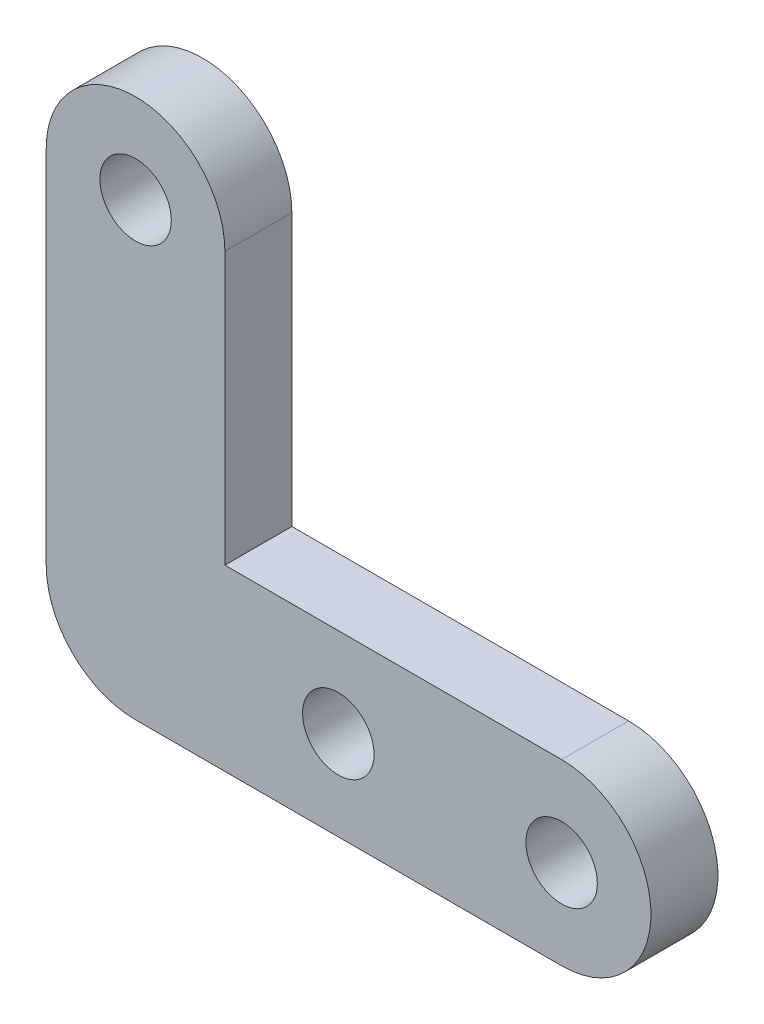
ISO-10303-21;
HEADER;
FILE_DESCRIPTION(('STEP AP214'),'2;1');
FILE_NAME('part.step','',(''),(''),'','','');
FILE_SCHEMA(('AUTOMOTIVE_DESIGN { 1 0 10303 214 1 1 1 1 }'));
ENDSEC;
DATA;
#1=APPLICATION_CONTEXT('core data for automotive mechanical design processes');
#2=APPLICATION_PROTOCOL_DEFINITION('international standard','automotive_design',2000,#1);
#3=PRODUCT_CONTEXT('',#1,'mechanical');
#4=PRODUCT('Part','Part','',(#3));
#5=PRODUCT_RELATED_PRODUCT_CATEGORY('part','',(#4));
#6=PRODUCT_DEFINITION_FORMATION('','',#4);
#7=PRODUCT_DEFINITION_CONTEXT('part definition',#1,'design');
#8=PRODUCT_DEFINITION('design','',#6,#7);
#9=PRODUCT_DEFINITION_SHAPE('','',#8);
#10=(LENGTH_UNIT() NAMED_UNIT(*) SI_UNIT(.MILLI.,.METRE.));
#11=(NAMED_UNIT(*) PLANE_ANGLE_UNIT() SI_UNIT($,.RADIAN.));
#12=(NAMED_UNIT(*) SI_UNIT($,.STERADIAN.) SOLID_ANGLE_UNIT());
#13=UNCERTAINTY_MEASURE_WITH_UNIT(LENGTH_MEASURE(1.E-05),#10,'distance_accuracy_value','');
#14=(GEOMETRIC_REPRESENTATION_CONTEXT(3) GLOBAL_UNCERTAINTY_ASSIGNED_CONTEXT((#13)) GLOBAL_UNIT_ASSIGNED_CONTEXT((#10,
#11,#12)) REPRESENTATION_CONTEXT('',''));
#15=CARTESIAN_POINT('',(0.,0.,0.));
#16=DIRECTION('',(0.,0.,1.));
#17=DIRECTION('',(1.,0.,0.));
#18=AXIS2_PLACEMENT_3D('',#15,#16,#17);
#19=CARTESIAN_POINT('',(0.,-4.,4.));
#20=DIRECTION('',(0.,-1.,0.));
#21=DIRECTION('',(1.,0.,0.));
#22=AXIS2_PLACEMENT_3D('',#19,#20,#21);
#23=PLANE('',#22);
#24=DIRECTION('',(0.,0.,1.));
#25=VECTOR('',#24,1.);
#26=CARTESIAN_POINT('',(0.,-4.,4.));
#27=LINE('',#26,#25);
#28=CARTESIAN_POINT('',(0.,-4.,1.));
#29=VERTEX_POINT('',#28);
#30=CARTESIAN_POINT('',(0.,-4.,4.));
#31=VERTEX_POINT('',#30);
#32=EDGE_CURVE('E11',#29,#31,#27,.T.);
#33=ORIENTED_EDGE('',*,*,#32,.F.);
#34=DIRECTION('',(1.,0.,0.));
#35=VECTOR('',#34,1.);
#36=CARTESIAN_POINT('',(0.,-4.,1.));
#37=LINE('',#36,#35);
#38=CARTESIAN_POINT('',(19.08,-4.,1.));
#39=VERTEX_POINT('',#38);
#40=EDGE_CURVE('E105',#29,#39,#37,.T.);
#41=ORIENTED_EDGE('',*,*,#40,.T.);
#42=DIRECTION('',(0.,0.,1.));
#43=VECTOR('',#42,1.);
#44=CARTESIAN_POINT('',(19.08,-4.,4.));
#45=LINE('',#44,#43);
#46=CARTESIAN_POINT('',(19.08,-4.,4.));
#47=VERTEX_POINT('',#46);
#48=EDGE_CURVE('E49',#39,#47,#45,.T.);
#49=ORIENTED_EDGE('',*,*,#48,.T.);
#50=DIRECTION('',(1.,0.,0.));
#51=VECTOR('',#50,1.);
#52=CARTESIAN_POINT('',(0.,-4.,4.));
#53=LINE('',#52,#51);
#54=EDGE_CURVE('E147',#31,#47,#53,.T.);
#55=ORIENTED_EDGE('',*,*,#54,.F.);
#56=EDGE_LOOP('',(#33,#41,#49,#55));
#57=FACE_BOUND('',#56,.T.);
#58=ADVANCED_FACE('F39',(#57),#23,.T.);
#59=CARTESIAN_POINT('',(19.08,0.,4.));
#60=DIRECTION('',(0.,0.,1.));
#61=DIRECTION('',(1.,0.,0.));
#62=AXIS2_PLACEMENT_3D('',#59,#60,#61);
#63=CYLINDRICAL_SURFACE('',#62,4.);
#64=ORIENTED_EDGE('',*,*,#48,.F.);
#65=CARTESIAN_POINT('',(19.08,0.,1.));
#66=DIRECTION('',(0.,0.,1.));
#67=DIRECTION('',(1.,0.,0.));
#68=AXIS2_PLACEMENT_3D('',#65,#66,#67);
#69=CIRCLE('',#68,4.);
#70=CARTESIAN_POINT('',(19.08,4.,1.));
#71=VERTEX_POINT('',#70);
#72=EDGE_CURVE('E121',#39,#71,#69,.T.);
#73=ORIENTED_EDGE('',*,*,#72,.T.);
#74=DIRECTION('',(0.,0.,1.));
#75=VECTOR('',#74,1.);
#76=CARTESIAN_POINT('',(19.08,4.,4.));
#77=LINE('',#76,#75);
#78=CARTESIAN_POINT('',(19.08,4.,4.));
#79=VERTEX_POINT('',#78);
#80=EDGE_CURVE('E140',#71,#79,#77,.T.);
#81=ORIENTED_EDGE('',*,*,#80,.T.);
#82=CARTESIAN_POINT('',(19.08,0.,4.));
#83=DIRECTION('',(0.,0.,1.));
#84=DIRECTION('',(1.,0.,0.));
#85=AXIS2_PLACEMENT_3D('',#82,#83,#84);
#86=CIRCLE('',#85,4.);
#87=EDGE_CURVE('E157',#47,#79,#86,.T.);
#88=ORIENTED_EDGE('',*,*,#87,.F.);
#89=EDGE_LOOP('',(#64,#73,#81,#88));
#90=FACE_BOUND('',#89,.T.);
#91=ADVANCED_FACE('F160',(#90),#63,.T.);
#92=CARTESIAN_POINT('',(0.,4.,4.));
#93=DIRECTION('',(0.,-1.,0.));
#94=DIRECTION('',(1.,0.,0.));
#95=AXIS2_PLACEMENT_3D('',#92,#93,#94);
#96=PLANE('',#95);
#97=ORIENTED_EDGE('',*,*,#80,.F.);
#98=DIRECTION('',(1.,0.,0.));
#99=VECTOR('',#98,1.);
#100=CARTESIAN_POINT('',(0.,4.,1.));
#101=LINE('',#100,#99);
#102=CARTESIAN_POINT('',(4.,4.,1.));
#103=VERTEX_POINT('',#102);
#104=EDGE_CURVE('E118',#103,#71,#101,.T.);
#105=ORIENTED_EDGE('',*,*,#104,.F.);
#106=DIRECTION('',(0.,0.,1.));
#107=VECTOR('',#106,1.);
#108=CARTESIAN_POINT('',(4.,4.,4.));
#109=LINE('',#108,#107);
#110=CARTESIAN_POINT('',(4.,4.,4.));
#111=VERTEX_POINT('',#110);
#112=EDGE_CURVE('E137',#103,#111,#109,.T.);
#113=ORIENTED_EDGE('',*,*,#112,.T.);
#114=DIRECTION('',(1.,0.,0.));
#115=VECTOR('',#114,1.);
#116=CARTESIAN_POINT('',(0.,4.,4.));
#117=LINE('',#116,#115);
#118=EDGE_CURVE('E161',#111,#79,#117,.T.);
#119=ORIENTED_EDGE('',*,*,#118,.T.);
#120=EDGE_LOOP('',(#97,#105,#113,#119));
#121=FACE_BOUND('',#120,.T.);
#122=ADVANCED_FACE('F196',(#121),#96,.F.);
#123=CARTESIAN_POINT('',(4.,0.,4.));
#124=DIRECTION('',(1.,0.,0.));
#125=DIRECTION('',(0.,1.,0.));
#126=AXIS2_PLACEMENT_3D('',#123,#124,#125);
#127=PLANE('',#126);
#128=ORIENTED_EDGE('',*,*,#112,.F.);
#129=DIRECTION('',(0.,1.,0.));
#130=VECTOR('',#129,1.);
#131=CARTESIAN_POINT('',(4.,0.,1.));
#132=LINE('',#131,#130);
#133=CARTESIAN_POINT('',(4.,16.17,1.));
#134=VERTEX_POINT('',#133);
#135=EDGE_CURVE('E115',#103,#134,#132,.T.);
#136=ORIENTED_EDGE('',*,*,#135,.T.);
#137=DIRECTION('',(0.,0.,1.));
#138=VECTOR('',#137,1.);
#139=CARTESIAN_POINT('',(4.,16.17,4.));
#140=LINE('',#139,#138);
#141=CARTESIAN_POINT('',(4.,16.17,4.));
#142=VERTEX_POINT('',#141);
#143=EDGE_CURVE('E135',#134,#142,#140,.T.);
#144=ORIENTED_EDGE('',*,*,#143,.T.);
#145=DIRECTION('',(0.,1.,0.));
#146=VECTOR('',#145,1.);
#147=CARTESIAN_POINT('',(4.,0.,4.));
#148=LINE('',#147,#146);
#149=EDGE_CURVE('E163',#111,#142,#148,.T.);
#150=ORIENTED_EDGE('',*,*,#149,.F.);
#151=EDGE_LOOP('',(#128,#136,#144,#150));
#152=FACE_BOUND('',#151,.T.);
#153=ADVANCED_FACE('F256',(#152),#127,.T.);
#154=CARTESIAN_POINT('',(0.,16.17,4.));
#155=DIRECTION('',(0.,0.,1.));
#156=DIRECTION('',(1.,0.,0.));
#157=AXIS2_PLACEMENT_3D('',#154,#155,#156);
#158=CYLINDRICAL_SURFACE('',#157,4.);
#159=ORIENTED_EDGE('',*,*,#143,.F.);
#160=CARTESIAN_POINT('',(0.,16.17,1.));
#161=DIRECTION('',(0.,0.,1.));
#162=DIRECTION('',(1.,0.,0.));
#163=AXIS2_PLACEMENT_3D('',#160,#161,#162);
#164=CIRCLE('',#163,4.);
#165=CARTESIAN_POINT('',(-4.,16.17,1.));
#166=VERTEX_POINT('',#165);
#167=EDGE_CURVE('E112',#134,#166,#164,.T.);
#168=ORIENTED_EDGE('',*,*,#167,.T.);
#169=DIRECTION('',(0.,0.,1.));
#170=VECTOR('',#169,1.);
#171=CARTESIAN_POINT('',(-4.,16.17,4.));
#172=LINE('',#171,#170);
#173=CARTESIAN_POINT('',(-4.,16.17,4.));
#174=VERTEX_POINT('',#173);
#175=EDGE_CURVE('E57',#166,#174,#172,.T.);
#176=ORIENTED_EDGE('',*,*,#175,.T.);
#177=CARTESIAN_POINT('',(0.,16.17,4.));
#178=DIRECTION('',(0.,0.,1.));
#179=DIRECTION('',(1.,0.,0.));
#180=AXIS2_PLACEMENT_3D('',#177,#178,#179);
#181=CIRCLE('',#180,4.);
#182=EDGE_CURVE('E169',#142,#174,#181,.T.);
#183=ORIENTED_EDGE('',*,*,#182,.F.);
#184=EDGE_LOOP('',(#159,#168,#176,#183));
#185=FACE_BOUND('',#184,.T.);
#186=ADVANCED_FACE('F266',(#185),#158,.T.);
#187=CARTESIAN_POINT('',(-4.,0.,4.));
#188=DIRECTION('',(1.,0.,0.));
#189=DIRECTION('',(0.,1.,0.));
#190=AXIS2_PLACEMENT_3D('',#187,#188,#189);
#191=PLANE('',#190);
#192=ORIENTED_EDGE('',*,*,#175,.F.);
#193=DIRECTION('',(0.,1.,0.));
#194=VECTOR('',#193,1.);
#195=CARTESIAN_POINT('',(-4.,0.,1.));
#196=LINE('',#195,#194);
#197=CARTESIAN_POINT('',(-4.,0.,1.));
#198=VERTEX_POINT('',#197);
#199=EDGE_CURVE('E103',#198,#166,#196,.T.);
#200=ORIENTED_EDGE('',*,*,#199,.F.);
#201=DIRECTION('',(0.,0.,1.));
#202=VECTOR('',#201,1.);
#203=CARTESIAN_POINT('',(-4.,0.,4.));
#204=LINE('',#203,#202);
#205=CARTESIAN_POINT('',(-4.,0.,4.));
#206=VERTEX_POINT('',#205);
#207=EDGE_CURVE('E43',#198,#206,#204,.T.);
#208=ORIENTED_EDGE('',*,*,#207,.T.);
#209=DIRECTION('',(0.,1.,0.));
#210=VECTOR('',#209,1.);
#211=CARTESIAN_POINT('',(-4.,0.,4.));
#212=LINE('',#211,#210);
#213=EDGE_CURVE('E133',#206,#174,#212,.T.);
#214=ORIENTED_EDGE('',*,*,#213,.T.);
#215=EDGE_LOOP('',(#192,#200,#208,#214));
#216=FACE_BOUND('',#215,.T.);
#217=ADVANCED_FACE('F107',(#216),#191,.F.);
#218=CARTESIAN_POINT('',(0.,0.,4.));
#219=DIRECTION('',(0.,0.,1.));
#220=DIRECTION('',(1.,0.,0.));
#221=AXIS2_PLACEMENT_3D('',#218,#219,#220);
#222=CYLINDRICAL_SURFACE('',#221,4.);
#223=CARTESIAN_POINT('',(0.,0.,1.));
#224=DIRECTION('',(0.,0.,1.));
#225=DIRECTION('',(1.,0.,0.));
#226=AXIS2_PLACEMENT_3D('',#223,#224,#225);
#227=CIRCLE('',#226,4.);
#228=EDGE_CURVE('E91',#198,#29,#227,.T.);
#229=ORIENTED_EDGE('',*,*,#228,.T.);
#230=ORIENTED_EDGE('',*,*,#32,.T.);
#231=CARTESIAN_POINT('',(0.,0.,4.));
#232=DIRECTION('',(0.,0.,1.));
#233=DIRECTION('',(1.,0.,0.));
#234=AXIS2_PLACEMENT_3D('',#231,#232,#233);
#235=CIRCLE('',#234,4.);
#236=EDGE_CURVE('E93',#206,#31,#235,.T.);
#237=ORIENTED_EDGE('',*,*,#236,.F.);
#238=ORIENTED_EDGE('',*,*,#207,.F.);
#239=EDGE_LOOP('',(#229,#230,#237,#238));
#240=FACE_BOUND('',#239,.T.);
#241=ADVANCED_FACE('F90',(#240),#222,.T.);
#242=CARTESIAN_POINT('',(0.,16.17,4.));
#243=DIRECTION('',(0.,0.,1.));
#244=DIRECTION('',(1.,0.,0.));
#245=AXIS2_PLACEMENT_3D('',#242,#243,#244);
#246=CYLINDRICAL_SURFACE('',#245,1.6);
#247=CARTESIAN_POINT('',(0.,16.17,4.));
#248=DIRECTION('',(0.,0.,1.));
#249=DIRECTION('',(1.,0.,0.));
#250=AXIS2_PLACEMENT_3D('',#247,#248,#249);
#251=CIRCLE('',#250,1.6);
#252=CARTESIAN_POINT('',(1.6,16.17,4.));
#253=VERTEX_POINT('',#252);
#254=EDGE_CURVE('E172',#253,#253,#251,.T.);
#255=ORIENTED_EDGE('',*,*,#254,.T.);
#256=EDGE_LOOP('',(#255));
#257=FACE_BOUND('',#256,.T.);
#258=CARTESIAN_POINT('',(0.,16.17,1.));
#259=DIRECTION('',(0.,0.,1.));
#260=DIRECTION('',(1.,0.,0.));
#261=AXIS2_PLACEMENT_3D('',#258,#259,#260);
#262=CIRCLE('',#261,1.6);
#263=CARTESIAN_POINT('',(1.6,16.17,1.));
#264=VERTEX_POINT('',#263);
#265=EDGE_CURVE('E114',#264,#264,#262,.T.);
#266=ORIENTED_EDGE('',*,*,#265,.F.);
#267=EDGE_LOOP('',(#266));
#268=FACE_BOUND('',#267,.T.);
#269=ADVANCED_FACE('F202',(#257,#268),#246,.F.);
#270=CARTESIAN_POINT('',(9.08,0.,4.));
#271=DIRECTION('',(0.,0.,1.));
#272=DIRECTION('',(1.,0.,0.));
#273=AXIS2_PLACEMENT_3D('',#270,#271,#272);
#274=CYLINDRICAL_SURFACE('',#273,1.6);
#275=CARTESIAN_POINT('',(9.08,0.,4.));
#276=DIRECTION('',(0.,0.,1.));
#277=DIRECTION('',(1.,0.,0.));
#278=AXIS2_PLACEMENT_3D('',#275,#276,#277);
#279=CIRCLE('',#278,1.6);
#280=CARTESIAN_POINT('',(10.68,0.,4.));
#281=VERTEX_POINT('',#280);
#282=EDGE_CURVE('E174',#281,#281,#279,.T.);
#283=ORIENTED_EDGE('',*,*,#282,.T.);
#284=EDGE_LOOP('',(#283));
#285=FACE_BOUND('',#284,.T.);
#286=CARTESIAN_POINT('',(9.08,0.,1.));
#287=DIRECTION('',(0.,0.,1.));
#288=DIRECTION('',(1.,0.,0.));
#289=AXIS2_PLACEMENT_3D('',#286,#287,#288);
#290=CIRCLE('',#289,1.6);
#291=CARTESIAN_POINT('',(10.68,0.,1.));
#292=VERTEX_POINT('',#291);
#293=EDGE_CURVE('E127',#292,#292,#290,.T.);
#294=ORIENTED_EDGE('',*,*,#293,.F.);
#295=EDGE_LOOP('',(#294));
#296=FACE_BOUND('',#295,.T.);
#297=ADVANCED_FACE('F190',(#285,#296),#274,.F.);
#298=CARTESIAN_POINT('',(19.08,0.,4.));
#299=DIRECTION('',(0.,0.,1.));
#300=DIRECTION('',(1.,0.,0.));
#301=AXIS2_PLACEMENT_3D('',#298,#299,#300);
#302=CYLINDRICAL_SURFACE('',#301,1.6);
#303=CARTESIAN_POINT('',(19.08,0.,4.));
#304=DIRECTION('',(0.,0.,1.));
#305=DIRECTION('',(1.,0.,0.));
#306=AXIS2_PLACEMENT_3D('',#303,#304,#305);
#307=CIRCLE('',#306,1.6);
#308=CARTESIAN_POINT('',(20.68,0.,4.));
#309=VERTEX_POINT('',#308);
#310=EDGE_CURVE('E97',#309,#309,#307,.T.);
#311=ORIENTED_EDGE('',*,*,#310,.T.);
#312=EDGE_LOOP('',(#311));
#313=FACE_BOUND('',#312,.T.);
#314=CARTESIAN_POINT('',(19.08,0.,1.));
#315=DIRECTION('',(0.,0.,1.));
#316=DIRECTION('',(1.,0.,0.));
#317=AXIS2_PLACEMENT_3D('',#314,#315,#316);
#318=CIRCLE('',#317,1.6);
#319=CARTESIAN_POINT('',(20.68,0.,1.));
#320=VERTEX_POINT('',#319);
#321=EDGE_CURVE('E130',#320,#320,#318,.T.);
#322=ORIENTED_EDGE('',*,*,#321,.F.);
#323=EDGE_LOOP('',(#322));
#324=FACE_BOUND('',#323,.T.);
#325=ADVANCED_FACE('F41',(#313,#324),#302,.F.);
#326=CARTESIAN_POINT('',(0.,0.,4.));
#327=DIRECTION('',(0.,0.,1.));
#328=DIRECTION('',(1.,0.,0.));
#329=AXIS2_PLACEMENT_3D('',#326,#327,#328);
#330=PLANE('',#329);
#331=ORIENTED_EDGE('',*,*,#213,.F.);
#332=ORIENTED_EDGE('',*,*,#236,.T.);
#333=ORIENTED_EDGE('',*,*,#54,.T.);
#334=ORIENTED_EDGE('',*,*,#87,.T.);
#335=ORIENTED_EDGE('',*,*,#118,.F.);
#336=ORIENTED_EDGE('',*,*,#149,.T.);
#337=ORIENTED_EDGE('',*,*,#182,.T.);
#338=EDGE_LOOP('',(#331,#332,#333,#334,#335,#336,#337));
#339=FACE_BOUND('',#338,.T.);
#340=ORIENTED_EDGE('',*,*,#254,.F.);
#341=EDGE_LOOP('',(#340));
#342=FACE_BOUND('',#341,.T.);
#343=ORIENTED_EDGE('',*,*,#282,.F.);
#344=EDGE_LOOP('',(#343));
#345=FACE_BOUND('',#344,.T.);
#346=ORIENTED_EDGE('',*,*,#310,.F.);
#347=EDGE_LOOP('',(#346));
#348=FACE_BOUND('',#347,.T.);
#349=ADVANCED_FACE('F154',(#339,#342,#345,#348),#330,.T.);
#350=CARTESIAN_POINT('',(0.,0.,1.));
#351=DIRECTION('',(0.,0.,1.));
#352=DIRECTION('',(1.,0.,0.));
#353=AXIS2_PLACEMENT_3D('',#350,#351,#352);
#354=PLANE('',#353);
#355=ORIENTED_EDGE('',*,*,#199,.T.);
#356=ORIENTED_EDGE('',*,*,#167,.F.);
#357=ORIENTED_EDGE('',*,*,#135,.F.);
#358=ORIENTED_EDGE('',*,*,#104,.T.);
#359=ORIENTED_EDGE('',*,*,#72,.F.);
#360=ORIENTED_EDGE('',*,*,#40,.F.);
#361=ORIENTED_EDGE('',*,*,#228,.F.);
#362=EDGE_LOOP('',(#355,#356,#357,#358,#359,#360,#361));
#363=FACE_BOUND('',#362,.T.);
#364=ORIENTED_EDGE('',*,*,#265,.T.);
#365=EDGE_LOOP('',(#364));
#366=FACE_BOUND('',#365,.T.);
#367=ORIENTED_EDGE('',*,*,#293,.T.);
#368=EDGE_LOOP('',(#367));
#369=FACE_BOUND('',#368,.T.);
#370=ORIENTED_EDGE('',*,*,#321,.T.);
#371=EDGE_LOOP('',(#370));
#372=FACE_BOUND('',#371,.T.);
#373=ADVANCED_FACE('F100',(#363,#366,#369,#372),#354,.F.);
#374=CLOSED_SHELL('',(#58,#91,#122,#153,#186,#217,#241,#269,#297,#325,#349,#373));
#375=MANIFOLD_SOLID_BREP('B2',#374);
#376=ADVANCED_BREP_SHAPE_REPRESENTATION('',(#18,#375),#14);
#377=SHAPE_DEFINITION_REPRESENTATION(#9,#376);
ENDSEC;
END-ISO-10303-21;
